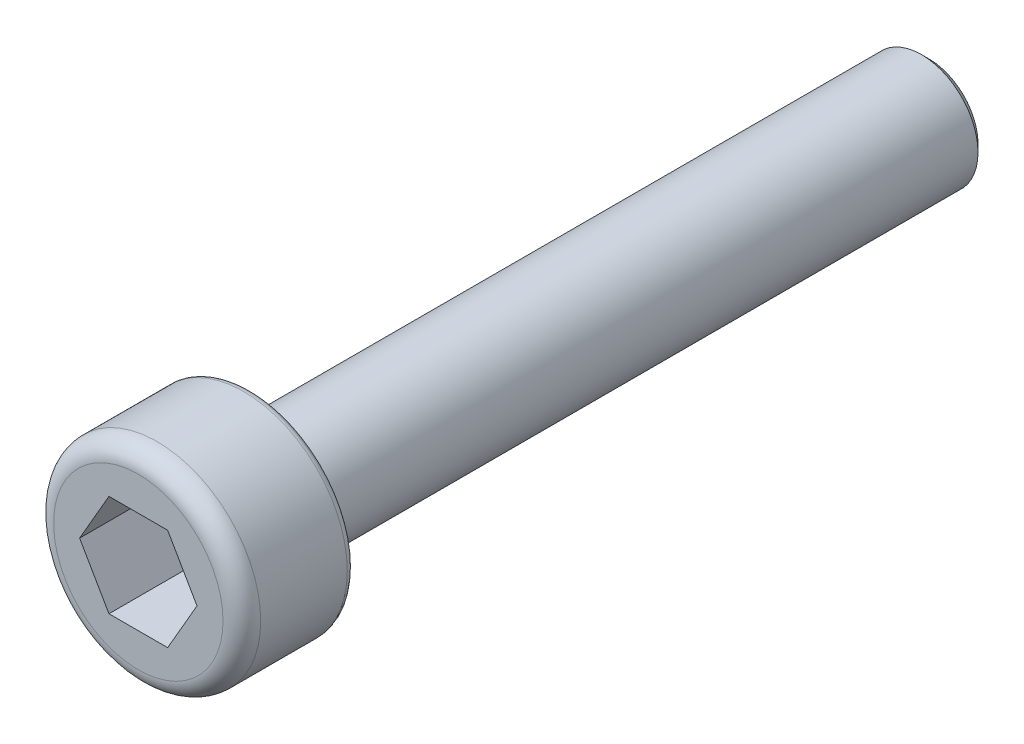
ISO-10303-21;
HEADER;
FILE_DESCRIPTION(('STEP AP214'),'2;1');
FILE_NAME('part.step','',(''),(''),'','','');
FILE_SCHEMA(('AUTOMOTIVE_DESIGN { 1 0 10303 214 1 1 1 1 }'));
ENDSEC;
DATA;
#1=APPLICATION_CONTEXT('core data for automotive mechanical design processes');
#2=APPLICATION_PROTOCOL_DEFINITION('international standard','automotive_design',2000,#1);
#3=PRODUCT_CONTEXT('',#1,'mechanical');
#4=PRODUCT('Part','Part','',(#3));
#5=PRODUCT_RELATED_PRODUCT_CATEGORY('part','',(#4));
#6=PRODUCT_DEFINITION_FORMATION('','',#4);
#7=PRODUCT_DEFINITION_CONTEXT('part definition',#1,'design');
#8=PRODUCT_DEFINITION('design','',#6,#7);
#9=PRODUCT_DEFINITION_SHAPE('','',#8);
#10=(LENGTH_UNIT() NAMED_UNIT(*) SI_UNIT(.MILLI.,.METRE.));
#11=(NAMED_UNIT(*) PLANE_ANGLE_UNIT() SI_UNIT($,.RADIAN.));
#12=(NAMED_UNIT(*) SI_UNIT($,.STERADIAN.) SOLID_ANGLE_UNIT());
#13=UNCERTAINTY_MEASURE_WITH_UNIT(LENGTH_MEASURE(1.E-05),#10,'distance_accuracy_value','');
#14=(GEOMETRIC_REPRESENTATION_CONTEXT(3) GLOBAL_UNCERTAINTY_ASSIGNED_CONTEXT((#13)) GLOBAL_UNIT_ASSIGNED_CONTEXT((#10,
#11,#12)) REPRESENTATION_CONTEXT('',''));
#15=CARTESIAN_POINT('',(0.,0.,0.));
#16=DIRECTION('',(0.,0.,1.));
#17=DIRECTION('',(1.,0.,0.));
#18=AXIS2_PLACEMENT_3D('',#15,#16,#17);
#19=CARTESIAN_POINT('',(0.,0.,0.));
#20=DIRECTION('',(0.,0.,1.));
#21=DIRECTION('',(1.,0.,0.));
#22=AXIS2_PLACEMENT_3D('',#19,#20,#21);
#23=PLANE('',#22);
#24=CARTESIAN_POINT('',(0.,0.,0.));
#25=DIRECTION('',(0.,0.,1.));
#26=DIRECTION('',(1.,0.,0.));
#27=AXIS2_PLACEMENT_3D('',#24,#25,#26);
#28=CIRCLE('',#27,2.55);
#29=CARTESIAN_POINT('',(2.55,0.,0.));
#30=VERTEX_POINT('',#29);
#31=EDGE_CURVE('E11',#30,#30,#28,.F.);
#32=ORIENTED_EDGE('',*,*,#31,.T.);
#33=EDGE_LOOP('',(#32));
#34=FACE_BOUND('',#33,.T.);
#35=CARTESIAN_POINT('',(0.,0.,0.));
#36=DIRECTION('',(0.,0.,1.));
#37=DIRECTION('',(1.,0.,0.));
#38=AXIS2_PLACEMENT_3D('',#35,#36,#37);
#39=CIRCLE('',#38,1.5);
#40=CARTESIAN_POINT('',(1.5,0.,0.));
#41=VERTEX_POINT('',#40);
#42=EDGE_CURVE('E149',#41,#41,#39,.F.);
#43=ORIENTED_EDGE('',*,*,#42,.F.);
#44=EDGE_LOOP('',(#43));
#45=FACE_BOUND('',#44,.T.);
#46=ADVANCED_FACE('F36',(#34,#45),#23,.F.);
#47=CARTESIAN_POINT('',(0.,0.,3.));
#48=DIRECTION('',(0.,0.,-1.));
#49=DIRECTION('',(-1.,0.,0.));
#50=AXIS2_PLACEMENT_3D('',#47,#48,#49);
#51=CYLINDRICAL_SURFACE('',#50,2.75);
#52=CARTESIAN_POINT('',(0.,0.,0.2));
#53=DIRECTION('',(0.,0.,1.));
#54=DIRECTION('',(1.,0.,0.));
#55=AXIS2_PLACEMENT_3D('',#52,#53,#54);
#56=CIRCLE('',#55,2.75);
#57=CARTESIAN_POINT('',(2.75,0.,0.2));
#58=VERTEX_POINT('',#57);
#59=EDGE_CURVE('E44',#58,#58,#56,.T.);
#60=ORIENTED_EDGE('',*,*,#59,.T.);
#61=EDGE_LOOP('',(#60));
#62=FACE_BOUND('',#61,.T.);
#63=CARTESIAN_POINT('',(0.,0.,2.5));
#64=DIRECTION('',(0.,0.,1.));
#65=DIRECTION('',(1.,0.,0.));
#66=AXIS2_PLACEMENT_3D('',#63,#64,#65);
#67=CIRCLE('',#66,2.75);
#68=CARTESIAN_POINT('',(2.75,0.,2.5));
#69=VERTEX_POINT('',#68);
#70=EDGE_CURVE('E146',#69,#69,#67,.F.);
#71=ORIENTED_EDGE('',*,*,#70,.T.);
#72=EDGE_LOOP('',(#71));
#73=FACE_BOUND('',#72,.T.);
#74=ADVANCED_FACE('F160',(#62,#73),#51,.T.);
#75=CARTESIAN_POINT('',(0.,0.,3.));
#76=DIRECTION('',(0.,0.,1.));
#77=DIRECTION('',(1.,0.,0.));
#78=AXIS2_PLACEMENT_3D('',#75,#76,#77);
#79=PLANE('',#78);
#80=DIRECTION('',(0.5,0.866025403784439,0.));
#81=VECTOR('',#80,1.);
#82=CARTESIAN_POINT('',(0.779422863405995,-1.35,3.));
#83=LINE('',#82,#81);
#84=CARTESIAN_POINT('',(0.779422863405995,-1.35,3.));
#85=VERTEX_POINT('',#84);
#86=CARTESIAN_POINT('',(1.55884572681199,0.,3.));
#87=VERTEX_POINT('',#86);
#88=EDGE_CURVE('E51',#85,#87,#83,.T.);
#89=ORIENTED_EDGE('',*,*,#88,.F.);
#90=DIRECTION('',(1.,0.,0.));
#91=VECTOR('',#90,1.);
#92=CARTESIAN_POINT('',(-0.779422863405994,-1.35,3.));
#93=LINE('',#92,#91);
#94=CARTESIAN_POINT('',(-0.779422863405994,-1.35,3.));
#95=VERTEX_POINT('',#94);
#96=EDGE_CURVE('E134',#95,#85,#93,.T.);
#97=ORIENTED_EDGE('',*,*,#96,.F.);
#98=DIRECTION('',(0.5,-0.866025403784438,0.));
#99=VECTOR('',#98,1.);
#100=CARTESIAN_POINT('',(-1.55884572681199,0.,3.));
#101=LINE('',#100,#99);
#102=CARTESIAN_POINT('',(-1.55884572681199,0.,3.));
#103=VERTEX_POINT('',#102);
#104=EDGE_CURVE('E132',#103,#95,#101,.T.);
#105=ORIENTED_EDGE('',*,*,#104,.F.);
#106=DIRECTION('',(-0.5,-0.866025403784438,0.));
#107=VECTOR('',#106,1.);
#108=CARTESIAN_POINT('',(-0.779422863405995,1.35,3.));
#109=LINE('',#108,#107);
#110=CARTESIAN_POINT('',(-0.779422863405995,1.35,3.));
#111=VERTEX_POINT('',#110);
#112=EDGE_CURVE('E99',#111,#103,#109,.T.);
#113=ORIENTED_EDGE('',*,*,#112,.F.);
#114=DIRECTION('',(-1.,0.,0.));
#115=VECTOR('',#114,1.);
#116=CARTESIAN_POINT('',(0.779422863405994,1.35,3.));
#117=LINE('',#116,#115);
#118=CARTESIAN_POINT('',(0.779422863405994,1.35,3.));
#119=VERTEX_POINT('',#118);
#120=EDGE_CURVE('E128',#119,#111,#117,.T.);
#121=ORIENTED_EDGE('',*,*,#120,.F.);
#122=DIRECTION('',(-0.5,0.866025403784438,0.));
#123=VECTOR('',#122,1.);
#124=CARTESIAN_POINT('',(1.55884572681199,0.,3.));
#125=LINE('',#124,#123);
#126=EDGE_CURVE('E125',#87,#119,#125,.T.);
#127=ORIENTED_EDGE('',*,*,#126,.F.);
#128=EDGE_LOOP('',(#89,#97,#105,#113,#121,#127));
#129=FACE_BOUND('',#128,.T.);
#130=CARTESIAN_POINT('',(0.,0.,3.));
#131=DIRECTION('',(0.,0.,1.));
#132=DIRECTION('',(1.,0.,0.));
#133=AXIS2_PLACEMENT_3D('',#130,#131,#132);
#134=CIRCLE('',#133,2.25);
#135=CARTESIAN_POINT('',(2.25,0.,3.));
#136=VERTEX_POINT('',#135);
#137=EDGE_CURVE('E138',#136,#136,#134,.T.);
#138=ORIENTED_EDGE('',*,*,#137,.T.);
#139=EDGE_LOOP('',(#138));
#140=FACE_BOUND('',#139,.T.);
#141=ADVANCED_FACE('F178',(#129,#140),#79,.T.);
#142=CARTESIAN_POINT('',(0.,0.,2.5));
#143=DIRECTION('',(0.,0.,1.));
#144=DIRECTION('',(1.,0.,0.));
#145=AXIS2_PLACEMENT_3D('',#142,#143,#144);
#146=TOROIDAL_SURFACE('',#145,2.25,0.5);
#147=ORIENTED_EDGE('',*,*,#70,.F.);
#148=EDGE_LOOP('',(#147));
#149=FACE_BOUND('',#148,.T.);
#150=ORIENTED_EDGE('',*,*,#137,.F.);
#151=EDGE_LOOP('',(#150));
#152=FACE_BOUND('',#151,.T.);
#153=ADVANCED_FACE('F184',(#149,#152),#146,.T.);
#154=CARTESIAN_POINT('',(0.779422863405995,-1.35,1.));
#155=DIRECTION('',(0.866025403784439,-0.5,0.));
#156=DIRECTION('',(0.5,0.866025403784439,0.));
#157=AXIS2_PLACEMENT_3D('',#154,#155,#156);
#158=PLANE('',#157);
#159=ORIENTED_EDGE('',*,*,#88,.T.);
#160=DIRECTION('',(0.,0.,1.));
#161=VECTOR('',#160,1.);
#162=CARTESIAN_POINT('',(1.55884572681199,0.,1.));
#163=LINE('',#162,#161);
#164=CARTESIAN_POINT('',(1.55884572681199,0.,1.));
#165=VERTEX_POINT('',#164);
#166=EDGE_CURVE('E81',#165,#87,#163,.T.);
#167=ORIENTED_EDGE('',*,*,#166,.F.);
#168=DIRECTION('',(0.5,0.866025403784439,0.));
#169=VECTOR('',#168,1.);
#170=CARTESIAN_POINT('',(0.779422863405995,-1.35,1.));
#171=LINE('',#170,#169);
#172=CARTESIAN_POINT('',(0.779422863405995,-1.35,1.));
#173=VERTEX_POINT('',#172);
#174=EDGE_CURVE('E136',#173,#165,#171,.T.);
#175=ORIENTED_EDGE('',*,*,#174,.F.);
#176=DIRECTION('',(0.,0.,1.));
#177=VECTOR('',#176,1.);
#178=CARTESIAN_POINT('',(0.779422863405995,-1.35,1.));
#179=LINE('',#178,#177);
#180=EDGE_CURVE('E59',#173,#85,#179,.T.);
#181=ORIENTED_EDGE('',*,*,#180,.T.);
#182=EDGE_LOOP('',(#159,#167,#175,#181));
#183=FACE_BOUND('',#182,.T.);
#184=ADVANCED_FACE('F186',(#183),#158,.F.);
#185=CARTESIAN_POINT('',(-0.779422863405994,-1.35,1.));
#186=DIRECTION('',(0.,-1.,0.));
#187=DIRECTION('',(0.,0.,-1.));
#188=AXIS2_PLACEMENT_3D('',#185,#186,#187);
#189=PLANE('',#188);
#190=ORIENTED_EDGE('',*,*,#96,.T.);
#191=ORIENTED_EDGE('',*,*,#180,.F.);
#192=DIRECTION('',(1.,0.,0.));
#193=VECTOR('',#192,1.);
#194=CARTESIAN_POINT('',(-0.779422863405994,-1.35,1.));
#195=LINE('',#194,#193);
#196=CARTESIAN_POINT('',(-0.779422863405994,-1.35,1.));
#197=VERTEX_POINT('',#196);
#198=EDGE_CURVE('E111',#197,#173,#195,.T.);
#199=ORIENTED_EDGE('',*,*,#198,.F.);
#200=DIRECTION('',(0.,0.,1.));
#201=VECTOR('',#200,1.);
#202=CARTESIAN_POINT('',(-0.779422863405994,-1.35,1.));
#203=LINE('',#202,#201);
#204=EDGE_CURVE('E103',#197,#95,#203,.T.);
#205=ORIENTED_EDGE('',*,*,#204,.T.);
#206=EDGE_LOOP('',(#190,#191,#199,#205));
#207=FACE_BOUND('',#206,.T.);
#208=ADVANCED_FACE('F192',(#207),#189,.F.);
#209=CARTESIAN_POINT('',(-1.55884572681199,0.,1.));
#210=DIRECTION('',(-0.866025403784438,-0.5,0.));
#211=DIRECTION('',(0.5,-0.866025403784438,0.));
#212=AXIS2_PLACEMENT_3D('',#209,#210,#211);
#213=PLANE('',#212);
#214=ORIENTED_EDGE('',*,*,#104,.T.);
#215=ORIENTED_EDGE('',*,*,#204,.F.);
#216=DIRECTION('',(0.5,-0.866025403784438,0.));
#217=VECTOR('',#216,1.);
#218=CARTESIAN_POINT('',(-1.55884572681199,0.,1.));
#219=LINE('',#218,#217);
#220=CARTESIAN_POINT('',(-1.55884572681199,0.,1.));
#221=VERTEX_POINT('',#220);
#222=EDGE_CURVE('E107',#221,#197,#219,.T.);
#223=ORIENTED_EDGE('',*,*,#222,.F.);
#224=DIRECTION('',(0.,0.,1.));
#225=VECTOR('',#224,1.);
#226=CARTESIAN_POINT('',(-1.55884572681199,0.,1.));
#227=LINE('',#226,#225);
#228=EDGE_CURVE('E92',#221,#103,#227,.T.);
#229=ORIENTED_EDGE('',*,*,#228,.T.);
#230=EDGE_LOOP('',(#214,#215,#223,#229));
#231=FACE_BOUND('',#230,.T.);
#232=ADVANCED_FACE('F108',(#231),#213,.F.);
#233=CARTESIAN_POINT('',(-0.779422863405995,1.35,1.));
#234=DIRECTION('',(-0.866025403784439,0.5,0.));
#235=DIRECTION('',(-0.5,-0.866025403784439,0.));
#236=AXIS2_PLACEMENT_3D('',#233,#234,#235);
#237=PLANE('',#236);
#238=ORIENTED_EDGE('',*,*,#112,.T.);
#239=ORIENTED_EDGE('',*,*,#228,.F.);
#240=DIRECTION('',(-0.5,-0.866025403784438,0.));
#241=VECTOR('',#240,1.);
#242=CARTESIAN_POINT('',(-0.779422863405995,1.35,1.));
#243=LINE('',#242,#241);
#244=CARTESIAN_POINT('',(-0.779422863405995,1.35,1.));
#245=VERTEX_POINT('',#244);
#246=EDGE_CURVE('E96',#245,#221,#243,.T.);
#247=ORIENTED_EDGE('',*,*,#246,.F.);
#248=DIRECTION('',(0.,0.,1.));
#249=VECTOR('',#248,1.);
#250=CARTESIAN_POINT('',(-0.779422863405995,1.35,1.));
#251=LINE('',#250,#249);
#252=EDGE_CURVE('E104',#245,#111,#251,.T.);
#253=ORIENTED_EDGE('',*,*,#252,.T.);
#254=EDGE_LOOP('',(#238,#239,#247,#253));
#255=FACE_BOUND('',#254,.T.);
#256=ADVANCED_FACE('F94',(#255),#237,.F.);
#257=CARTESIAN_POINT('',(0.779422863405994,1.35,1.));
#258=DIRECTION('',(0.,1.,0.));
#259=DIRECTION('',(0.,0.,1.));
#260=AXIS2_PLACEMENT_3D('',#257,#258,#259);
#261=PLANE('',#260);
#262=ORIENTED_EDGE('',*,*,#120,.T.);
#263=ORIENTED_EDGE('',*,*,#252,.F.);
#264=DIRECTION('',(-1.,0.,0.));
#265=VECTOR('',#264,1.);
#266=CARTESIAN_POINT('',(0.779422863405994,1.35,1.));
#267=LINE('',#266,#265);
#268=CARTESIAN_POINT('',(0.779422863405994,1.35,1.));
#269=VERTEX_POINT('',#268);
#270=EDGE_CURVE('E117',#269,#245,#267,.T.);
#271=ORIENTED_EDGE('',*,*,#270,.F.);
#272=DIRECTION('',(0.,0.,1.));
#273=VECTOR('',#272,1.);
#274=CARTESIAN_POINT('',(0.779422863405994,1.35,1.));
#275=LINE('',#274,#273);
#276=EDGE_CURVE('E141',#269,#119,#275,.T.);
#277=ORIENTED_EDGE('',*,*,#276,.T.);
#278=EDGE_LOOP('',(#262,#263,#271,#277));
#279=FACE_BOUND('',#278,.T.);
#280=ADVANCED_FACE('F217',(#279),#261,.F.);
#281=CARTESIAN_POINT('',(1.55884572681199,0.,1.));
#282=DIRECTION('',(0.866025403784438,0.5,0.));
#283=DIRECTION('',(-0.5,0.866025403784438,0.));
#284=AXIS2_PLACEMENT_3D('',#281,#282,#283);
#285=PLANE('',#284);
#286=ORIENTED_EDGE('',*,*,#126,.T.);
#287=ORIENTED_EDGE('',*,*,#276,.F.);
#288=DIRECTION('',(-0.5,0.866025403784438,0.));
#289=VECTOR('',#288,1.);
#290=CARTESIAN_POINT('',(1.55884572681199,0.,1.));
#291=LINE('',#290,#289);
#292=EDGE_CURVE('E119',#165,#269,#291,.T.);
#293=ORIENTED_EDGE('',*,*,#292,.F.);
#294=ORIENTED_EDGE('',*,*,#166,.T.);
#295=EDGE_LOOP('',(#286,#287,#293,#294));
#296=FACE_BOUND('',#295,.T.);
#297=ADVANCED_FACE('F204',(#296),#285,.F.);
#298=CARTESIAN_POINT('',(0.,0.,1.));
#299=DIRECTION('',(0.,0.,1.));
#300=DIRECTION('',(1.,0.,0.));
#301=AXIS2_PLACEMENT_3D('',#298,#299,#300);
#302=PLANE('',#301);
#303=ORIENTED_EDGE('',*,*,#174,.T.);
#304=ORIENTED_EDGE('',*,*,#292,.T.);
#305=ORIENTED_EDGE('',*,*,#270,.T.);
#306=ORIENTED_EDGE('',*,*,#246,.T.);
#307=ORIENTED_EDGE('',*,*,#222,.T.);
#308=ORIENTED_EDGE('',*,*,#198,.T.);
#309=EDGE_LOOP('',(#303,#304,#305,#306,#307,#308));
#310=FACE_BOUND('',#309,.T.);
#311=ADVANCED_FACE('F114',(#310),#302,.T.);
#312=CARTESIAN_POINT('',(0.,0.,-18.));
#313=DIRECTION('',(0.,0.,1.));
#314=DIRECTION('',(1.,0.,0.));
#315=AXIS2_PLACEMENT_3D('',#312,#313,#314);
#316=CYLINDRICAL_SURFACE('',#315,1.5);
#317=CARTESIAN_POINT('',(0.,0.,-17.8));
#318=DIRECTION('',(0.,0.,-1.));
#319=DIRECTION('',(-1.,0.,0.));
#320=AXIS2_PLACEMENT_3D('',#317,#318,#319);
#321=CIRCLE('',#320,1.5);
#322=CARTESIAN_POINT('',(-1.5,0.,-17.8));
#323=VERTEX_POINT('',#322);
#324=EDGE_CURVE('E155',#323,#323,#321,.F.);
#325=ORIENTED_EDGE('',*,*,#324,.T.);
#326=EDGE_LOOP('',(#325));
#327=FACE_BOUND('',#326,.T.);
#328=ORIENTED_EDGE('',*,*,#42,.T.);
#329=EDGE_LOOP('',(#328));
#330=FACE_BOUND('',#329,.T.);
#331=ADVANCED_FACE('F225',(#327,#330),#316,.T.);
#332=CARTESIAN_POINT('',(0.,0.,-18.));
#333=DIRECTION('',(0.,0.,-1.));
#334=DIRECTION('',(-1.,0.,0.));
#335=AXIS2_PLACEMENT_3D('',#332,#333,#334);
#336=PLANE('',#335);
#337=CARTESIAN_POINT('',(0.,0.,-18.));
#338=DIRECTION('',(0.,0.,-1.));
#339=DIRECTION('',(-1.,0.,0.));
#340=AXIS2_PLACEMENT_3D('',#337,#338,#339);
#341=CIRCLE('',#340,1.30000000000001);
#342=CARTESIAN_POINT('',(-1.30000000000001,0.,-18.));
#343=VERTEX_POINT('',#342);
#344=EDGE_CURVE('E152',#343,#343,#341,.T.);
#345=ORIENTED_EDGE('',*,*,#344,.T.);
#346=EDGE_LOOP('',(#345));
#347=FACE_BOUND('',#346,.T.);
#348=ADVANCED_FACE('F169',(#347),#336,.T.);
#349=CARTESIAN_POINT('',(0.,0.,-18.));
#350=DIRECTION('',(0.,0.,1.));
#351=DIRECTION('',(1.,0.,0.));
#352=AXIS2_PLACEMENT_3D('',#349,#350,#351);
#353=CONICAL_SURFACE('',#352,1.30000000000001,0.785398163397446);
#354=ORIENTED_EDGE('',*,*,#324,.F.);
#355=EDGE_LOOP('',(#354));
#356=FACE_BOUND('',#355,.T.);
#357=ORIENTED_EDGE('',*,*,#344,.F.);
#358=EDGE_LOOP('',(#357));
#359=FACE_BOUND('',#358,.T.);
#360=ADVANCED_FACE('F164',(#356,#359),#353,.T.);
#361=CARTESIAN_POINT('',(0.,0.,0.2));
#362=DIRECTION('',(0.,0.,1.));
#363=DIRECTION('',(1.,0.,0.));
#364=AXIS2_PLACEMENT_3D('',#361,#362,#363);
#365=TOROIDAL_SURFACE('',#364,2.55,0.2);
#366=ORIENTED_EDGE('',*,*,#31,.F.);
#367=EDGE_LOOP('',(#366));
#368=FACE_BOUND('',#367,.T.);
#369=ORIENTED_EDGE('',*,*,#59,.F.);
#370=EDGE_LOOP('',(#369));
#371=FACE_BOUND('',#370,.T.);
#372=ADVANCED_FACE('F38',(#368,#371),#365,.T.);
#373=CLOSED_SHELL('',(#46,#74,#141,#153,#184,#208,#232,#256,#280,#297,#311,#331,#348,#360,#372));
#374=MANIFOLD_SOLID_BREP('B2',#373);
#375=ADVANCED_BREP_SHAPE_REPRESENTATION('',(#18,#374),#14);
#376=SHAPE_DEFINITION_REPRESENTATION(#9,#375);
ENDSEC;
END-ISO-10303-21;
